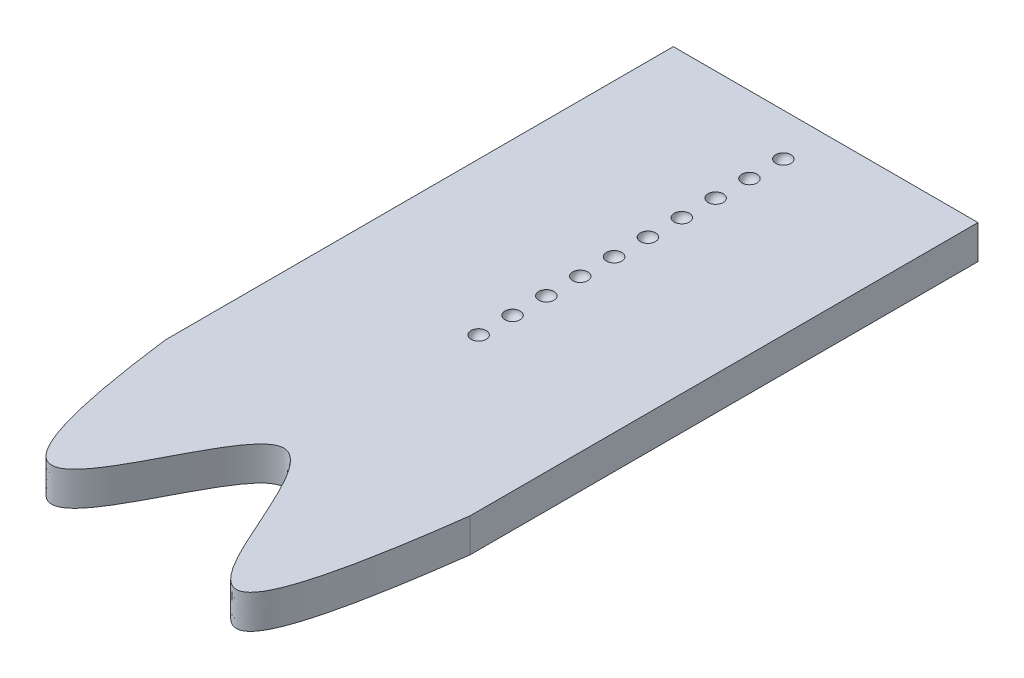
ISO-10303-21;
HEADER;
FILE_DESCRIPTION(('STEP AP214'),'2;1');
FILE_NAME('part.step','',(''),(''),'','','');
FILE_SCHEMA(('AUTOMOTIVE_DESIGN { 1 0 10303 214 1 1 1 1 }'));
ENDSEC;
DATA;
#1=APPLICATION_CONTEXT('core data for automotive mechanical design processes');
#2=APPLICATION_PROTOCOL_DEFINITION('international standard','automotive_design',2000,#1);
#3=PRODUCT_CONTEXT('',#1,'mechanical');
#4=PRODUCT('Part','Part','',(#3));
#5=PRODUCT_RELATED_PRODUCT_CATEGORY('part','',(#4));
#6=PRODUCT_DEFINITION_FORMATION('','',#4);
#7=PRODUCT_DEFINITION_CONTEXT('part definition',#1,'design');
#8=PRODUCT_DEFINITION('design','',#6,#7);
#9=PRODUCT_DEFINITION_SHAPE('','',#8);
#10=(LENGTH_UNIT() NAMED_UNIT(*) SI_UNIT(.MILLI.,.METRE.));
#11=(NAMED_UNIT(*) PLANE_ANGLE_UNIT() SI_UNIT($,.RADIAN.));
#12=(NAMED_UNIT(*) SI_UNIT($,.STERADIAN.) SOLID_ANGLE_UNIT());
#13=UNCERTAINTY_MEASURE_WITH_UNIT(LENGTH_MEASURE(1.E-05),#10,'distance_accuracy_value','');
#14=(GEOMETRIC_REPRESENTATION_CONTEXT(3) GLOBAL_UNCERTAINTY_ASSIGNED_CONTEXT((#13)) GLOBAL_UNIT_ASSIGNED_CONTEXT((#10,
#11,#12)) REPRESENTATION_CONTEXT('',''));
#15=CARTESIAN_POINT('',(0.,0.,0.));
#16=DIRECTION('',(0.,0.,1.));
#17=DIRECTION('',(1.,0.,0.));
#18=AXIS2_PLACEMENT_3D('',#15,#16,#17);
#19=CARTESIAN_POINT('',(-42.2653924914676,5.08,-3.81296928327645));
#20=DIRECTION('',(1.,0.,0.));
#21=DIRECTION('',(0.,0.,-1.));
#22=AXIS2_PLACEMENT_3D('',#19,#20,#21);
#23=PLANE('',#22);
#24=DIRECTION('',(0.,0.,1.));
#25=VECTOR('',#24,1.);
#26=CARTESIAN_POINT('',(-42.2653924914676,0.,-3.81296928327645));
#27=LINE('',#26,#25);
#28=CARTESIAN_POINT('',(-42.2653924914676,0.,-3.81296928327645));
#29=VERTEX_POINT('',#28);
#30=CARTESIAN_POINT('',(-42.2653924914676,0.,72.3870307167236));
#31=VERTEX_POINT('',#30);
#32=EDGE_CURVE('E113',#29,#31,#27,.T.);
#33=ORIENTED_EDGE('',*,*,#32,.T.);
#34=DIRECTION('',(0.,-1.,0.));
#35=VECTOR('',#34,1.);
#36=CARTESIAN_POINT('',(-42.2653924914676,5.08,72.3870307167236));
#37=LINE('',#36,#35);
#38=CARTESIAN_POINT('',(-42.2653924914676,5.08,72.3870307167236));
#39=VERTEX_POINT('',#38);
#40=EDGE_CURVE('E11',#39,#31,#37,.T.);
#41=ORIENTED_EDGE('',*,*,#40,.F.);
#42=DIRECTION('',(0.,0.,1.));
#43=VECTOR('',#42,1.);
#44=CARTESIAN_POINT('',(-42.2653924914676,5.08,-3.81296928327645));
#45=LINE('',#44,#43);
#46=CARTESIAN_POINT('',(-42.2653924914676,5.08,-3.81296928327645));
#47=VERTEX_POINT('',#46);
#48=EDGE_CURVE('E93',#47,#39,#45,.T.);
#49=ORIENTED_EDGE('',*,*,#48,.F.);
#50=DIRECTION('',(0.,-1.,0.));
#51=VECTOR('',#50,1.);
#52=CARTESIAN_POINT('',(-42.2653924914676,5.08,-3.81296928327645));
#53=LINE('',#52,#51);
#54=EDGE_CURVE('E106',#47,#29,#53,.T.);
#55=ORIENTED_EDGE('',*,*,#54,.T.);
#56=EDGE_LOOP('',(#33,#41,#49,#55));
#57=FACE_BOUND('',#56,.T.);
#58=ADVANCED_FACE('F39',(#57),#23,.F.);
#59=CARTESIAN_POINT('',(-42.2653924914676,5.08,72.3870307167236));
#60=CARTESIAN_POINT('',(-35.6116287089528,5.08,124.895548508635));
#61=CARTESIAN_POINT('',(-17.863111268053,5.08,27.5825207457818));
#62=CARTESIAN_POINT('',(-4.18793221957666,5.08,130.397350190675));
#63=CARTESIAN_POINT('',(3.45460750853244,5.08,72.3870307167236));
#64=B_SPLINE_CURVE_WITH_KNOTS('',3,(#59,#60,#61,#62,#63),.UNSPECIFIED.,.F.,.F.,(4,1,4),(0.,
0.483362267142511,1.),.UNSPECIFIED.);
#65=DIRECTION('',(0.,-1.,0.));
#66=VECTOR('',#65,1.);
#67=SURFACE_OF_LINEAR_EXTRUSION('',#64,#66);
#68=CARTESIAN_POINT('',(-42.2653924914676,0.,72.3870307167236));
#69=CARTESIAN_POINT('',(-35.6116287089528,0.,124.895548508635));
#70=CARTESIAN_POINT('',(-17.863111268053,0.,27.5825207457818));
#71=CARTESIAN_POINT('',(-4.18793221957666,0.,130.397350190675));
#72=CARTESIAN_POINT('',(3.45460750853244,0.,72.3870307167236));
#73=B_SPLINE_CURVE_WITH_KNOTS('',3,(#68,#69,#70,#71,#72),.UNSPECIFIED.,.F.,.F.,(4,1,4),(0.,
0.483362267142511,1.),.UNSPECIFIED.);
#74=CARTESIAN_POINT('',(3.45460750853243,0.,72.3870307167236));
#75=VERTEX_POINT('',#74);
#76=EDGE_CURVE('E98',#31,#75,#73,.T.);
#77=ORIENTED_EDGE('',*,*,#76,.T.);
#78=DIRECTION('',(0.,-1.,0.));
#79=VECTOR('',#78,1.);
#80=CARTESIAN_POINT('',(3.45460750853243,5.08,72.3870307167236));
#81=LINE('',#80,#79);
#82=CARTESIAN_POINT('',(3.45460750853243,5.08,72.3870307167236));
#83=VERTEX_POINT('',#82);
#84=EDGE_CURVE('E49',#83,#75,#81,.T.);
#85=ORIENTED_EDGE('',*,*,#84,.F.);
#86=EDGE_CURVE('E88',#39,#83,#64,.T.);
#87=ORIENTED_EDGE('',*,*,#86,.F.);
#88=ORIENTED_EDGE('',*,*,#40,.T.);
#89=EDGE_LOOP('',(#77,#85,#87,#88));
#90=FACE_BOUND('',#89,.T.);
#91=ADVANCED_FACE('F97',(#90),#67,.F.);
#92=CARTESIAN_POINT('',(3.45460750853242,5.08,-3.81296928327645));
#93=DIRECTION('',(-1.,0.,0.));
#94=DIRECTION('',(0.,0.,1.));
#95=AXIS2_PLACEMENT_3D('',#92,#93,#94);
#96=PLANE('',#95);
#97=DIRECTION('',(0.,0.,-1.));
#98=VECTOR('',#97,1.);
#99=CARTESIAN_POINT('',(3.45460750853242,0.,-3.81296928327645));
#100=LINE('',#99,#98);
#101=CARTESIAN_POINT('',(3.45460750853242,0.,-3.81296928327645));
#102=VERTEX_POINT('',#101);
#103=EDGE_CURVE('E75',#75,#102,#100,.T.);
#104=ORIENTED_EDGE('',*,*,#103,.T.);
#105=DIRECTION('',(0.,-1.,0.));
#106=VECTOR('',#105,1.);
#107=CARTESIAN_POINT('',(3.45460750853242,5.08,-3.81296928327645));
#108=LINE('',#107,#106);
#109=CARTESIAN_POINT('',(3.45460750853242,5.08,-3.81296928327645));
#110=VERTEX_POINT('',#109);
#111=EDGE_CURVE('E100',#110,#102,#108,.T.);
#112=ORIENTED_EDGE('',*,*,#111,.F.);
#113=DIRECTION('',(0.,0.,-1.));
#114=VECTOR('',#113,1.);
#115=CARTESIAN_POINT('',(3.45460750853242,5.08,-3.81296928327645));
#116=LINE('',#115,#114);
#117=EDGE_CURVE('E91',#83,#110,#116,.T.);
#118=ORIENTED_EDGE('',*,*,#117,.F.);
#119=ORIENTED_EDGE('',*,*,#84,.T.);
#120=EDGE_LOOP('',(#104,#112,#118,#119));
#121=FACE_BOUND('',#120,.T.);
#122=ADVANCED_FACE('F102',(#121),#96,.F.);
#123=CARTESIAN_POINT('',(-42.2653924914676,5.08,-3.81296928327645));
#124=DIRECTION('',(0.,0.,1.));
#125=DIRECTION('',(1.,0.,0.));
#126=AXIS2_PLACEMENT_3D('',#123,#124,#125);
#127=PLANE('',#126);
#128=DIRECTION('',(-1.,0.,0.));
#129=VECTOR('',#128,1.);
#130=CARTESIAN_POINT('',(-42.2653924914676,0.,-3.81296928327645));
#131=LINE('',#130,#129);
#132=EDGE_CURVE('E81',#102,#29,#131,.T.);
#133=ORIENTED_EDGE('',*,*,#132,.T.);
#134=ORIENTED_EDGE('',*,*,#54,.F.);
#135=DIRECTION('',(-1.,0.,0.));
#136=VECTOR('',#135,1.);
#137=CARTESIAN_POINT('',(-42.2653924914676,5.08,-3.81296928327645));
#138=LINE('',#137,#136);
#139=EDGE_CURVE('E58',#110,#47,#138,.T.);
#140=ORIENTED_EDGE('',*,*,#139,.F.);
#141=ORIENTED_EDGE('',*,*,#111,.T.);
#142=EDGE_LOOP('',(#133,#134,#140,#141));
#143=FACE_BOUND('',#142,.T.);
#144=ADVANCED_FACE('F177',(#143),#127,.F.);
#145=CARTESIAN_POINT('',(-18.6211082933293,5.08,77.7101564924303));
#146=DIRECTION('',(0.,-1.,0.));
#147=DIRECTION('',(0.,0.,-1.));
#148=AXIS2_PLACEMENT_3D('',#145,#146,#147);
#149=PLANE('',#148);
#150=CARTESIAN_POINT('',(-19.4053924914676,5.08,48.2570307167236));
#151=DIRECTION('',(0.,-1.,0.));
#152=DIRECTION('',(0.,0.,-1.));
#153=AXIS2_PLACEMENT_3D('',#150,#151,#152);
#154=CIRCLE('',#153,1.143);
#155=CARTESIAN_POINT('',(-19.4053924914676,5.08,47.1140307167236));
#156=VERTEX_POINT('',#155);
#157=EDGE_CURVE('E42',#156,#156,#154,.F.);
#158=ORIENTED_EDGE('',*,*,#157,.F.);
#159=EDGE_LOOP('',(#158));
#160=FACE_BOUND('',#159,.T.);
#161=CARTESIAN_POINT('',(-19.4053924914676,5.08,43.1770307167236));
#162=DIRECTION('',(0.,-1.,0.));
#163=DIRECTION('',(0.,0.,-1.));
#164=AXIS2_PLACEMENT_3D('',#161,#162,#163);
#165=CIRCLE('',#164,1.143);
#166=CARTESIAN_POINT('',(-19.4053924914676,5.08,42.0340307167236));
#167=VERTEX_POINT('',#166);
#168=EDGE_CURVE('E163',#167,#167,#165,.F.);
#169=ORIENTED_EDGE('',*,*,#168,.F.);
#170=EDGE_LOOP('',(#169));
#171=FACE_BOUND('',#170,.T.);
#172=CARTESIAN_POINT('',(-19.4053924914676,5.08,38.0970307167236));
#173=DIRECTION('',(0.,-1.,0.));
#174=DIRECTION('',(0.,0.,-1.));
#175=AXIS2_PLACEMENT_3D('',#172,#173,#174);
#176=CIRCLE('',#175,1.143);
#177=CARTESIAN_POINT('',(-19.4053924914676,5.08,36.9540307167236));
#178=VERTEX_POINT('',#177);
#179=EDGE_CURVE('E160',#178,#178,#176,.F.);
#180=ORIENTED_EDGE('',*,*,#179,.F.);
#181=EDGE_LOOP('',(#180));
#182=FACE_BOUND('',#181,.T.);
#183=CARTESIAN_POINT('',(-19.4053924914676,5.08,33.0170307167236));
#184=DIRECTION('',(0.,-1.,0.));
#185=DIRECTION('',(0.,0.,-1.));
#186=AXIS2_PLACEMENT_3D('',#183,#184,#185);
#187=CIRCLE('',#186,1.143);
#188=CARTESIAN_POINT('',(-19.4053924914676,5.08,31.8740307167236));
#189=VERTEX_POINT('',#188);
#190=EDGE_CURVE('E156',#189,#189,#187,.F.);
#191=ORIENTED_EDGE('',*,*,#190,.F.);
#192=EDGE_LOOP('',(#191));
#193=FACE_BOUND('',#192,.T.);
#194=CARTESIAN_POINT('',(-19.4053924914676,5.08,27.9370307167236));
#195=DIRECTION('',(0.,-1.,0.));
#196=DIRECTION('',(0.,0.,-1.));
#197=AXIS2_PLACEMENT_3D('',#194,#195,#196);
#198=CIRCLE('',#197,1.143);
#199=CARTESIAN_POINT('',(-19.4053924914676,5.08,26.7940307167236));
#200=VERTEX_POINT('',#199);
#201=EDGE_CURVE('E152',#200,#200,#198,.F.);
#202=ORIENTED_EDGE('',*,*,#201,.F.);
#203=EDGE_LOOP('',(#202));
#204=FACE_BOUND('',#203,.T.);
#205=CARTESIAN_POINT('',(-19.4053924914676,5.08,22.8570307167236));
#206=DIRECTION('',(0.,-1.,0.));
#207=DIRECTION('',(0.,0.,-1.));
#208=AXIS2_PLACEMENT_3D('',#205,#206,#207);
#209=CIRCLE('',#208,1.143);
#210=CARTESIAN_POINT('',(-19.4053924914676,5.08,21.7140307167236));
#211=VERTEX_POINT('',#210);
#212=EDGE_CURVE('E148',#211,#211,#209,.F.);
#213=ORIENTED_EDGE('',*,*,#212,.F.);
#214=EDGE_LOOP('',(#213));
#215=FACE_BOUND('',#214,.T.);
#216=CARTESIAN_POINT('',(-19.4053924914676,5.08,17.7770307167236));
#217=DIRECTION('',(0.,-1.,0.));
#218=DIRECTION('',(0.,0.,-1.));
#219=AXIS2_PLACEMENT_3D('',#216,#217,#218);
#220=CIRCLE('',#219,1.143);
#221=CARTESIAN_POINT('',(-19.4053924914676,5.08,16.6340307167236));
#222=VERTEX_POINT('',#221);
#223=EDGE_CURVE('E144',#222,#222,#220,.F.);
#224=ORIENTED_EDGE('',*,*,#223,.F.);
#225=EDGE_LOOP('',(#224));
#226=FACE_BOUND('',#225,.T.);
#227=CARTESIAN_POINT('',(-19.4053924914676,5.08,12.6970307167236));
#228=DIRECTION('',(0.,-1.,0.));
#229=DIRECTION('',(0.,0.,-1.));
#230=AXIS2_PLACEMENT_3D('',#227,#228,#229);
#231=CIRCLE('',#230,1.143);
#232=CARTESIAN_POINT('',(-19.4053924914676,5.08,11.5540307167236));
#233=VERTEX_POINT('',#232);
#234=EDGE_CURVE('E140',#233,#233,#231,.F.);
#235=ORIENTED_EDGE('',*,*,#234,.F.);
#236=EDGE_LOOP('',(#235));
#237=FACE_BOUND('',#236,.T.);
#238=CARTESIAN_POINT('',(-19.4053924914676,5.08,7.61703071672355));
#239=DIRECTION('',(0.,-1.,0.));
#240=DIRECTION('',(0.,0.,-1.));
#241=AXIS2_PLACEMENT_3D('',#238,#239,#240);
#242=CIRCLE('',#241,1.143);
#243=CARTESIAN_POINT('',(-19.4053924914676,5.08,6.47403071672356));
#244=VERTEX_POINT('',#243);
#245=EDGE_CURVE('E136',#244,#244,#242,.F.);
#246=ORIENTED_EDGE('',*,*,#245,.F.);
#247=EDGE_LOOP('',(#246));
#248=FACE_BOUND('',#247,.T.);
#249=CARTESIAN_POINT('',(-19.4053924914676,5.08,2.53703071672355));
#250=DIRECTION('',(0.,-1.,0.));
#251=DIRECTION('',(0.,0.,-1.));
#252=AXIS2_PLACEMENT_3D('',#249,#250,#251);
#253=CIRCLE('',#252,1.143);
#254=CARTESIAN_POINT('',(-19.4053924914676,5.08,1.39403071672356));
#255=VERTEX_POINT('',#254);
#256=EDGE_CURVE('E117',#255,#255,#253,.F.);
#257=ORIENTED_EDGE('',*,*,#256,.F.);
#258=EDGE_LOOP('',(#257));
#259=FACE_BOUND('',#258,.T.);
#260=ORIENTED_EDGE('',*,*,#48,.T.);
#261=ORIENTED_EDGE('',*,*,#86,.T.);
#262=ORIENTED_EDGE('',*,*,#117,.T.);
#263=ORIENTED_EDGE('',*,*,#139,.T.);
#264=EDGE_LOOP('',(#260,#261,#262,#263));
#265=FACE_BOUND('',#264,.T.);
#266=ADVANCED_FACE('F89',(#160,#171,#182,#193,#204,#215,#226,#237,#248,#259,#265),#149,.F.);
#267=CARTESIAN_POINT('',(-18.6211082933293,0.,77.7101564924303));
#268=DIRECTION('',(0.,-1.,0.));
#269=DIRECTION('',(0.,0.,-1.));
#270=AXIS2_PLACEMENT_3D('',#267,#268,#269);
#271=PLANE('',#270);
#272=ORIENTED_EDGE('',*,*,#32,.F.);
#273=ORIENTED_EDGE('',*,*,#132,.F.);
#274=ORIENTED_EDGE('',*,*,#103,.F.);
#275=ORIENTED_EDGE('',*,*,#76,.F.);
#276=EDGE_LOOP('',(#272,#273,#274,#275));
#277=FACE_BOUND('',#276,.T.);
#278=ADVANCED_FACE('F176',(#277),#271,.T.);
#279=CARTESIAN_POINT('',(-19.4053924914676,5.08,2.53703071672355));
#280=DIRECTION('',(-1.,0.,0.));
#281=DIRECTION('',(0.,0.,-1.));
#282=AXIS2_PLACEMENT_3D('',#279,#280,#281);
#283=SPHERICAL_SURFACE('',#282,1.143);
#284=CARTESIAN_POINT('',(-19.4053924914676,5.08,2.53703071672355));
#285=DIRECTION('',(0.,-1.,0.));
#286=DIRECTION('',(0.,0.,-1.));
#287=AXIS2_PLACEMENT_3D('',#284,#285,#286);
#288=SPHERICAL_SURFACE('',#287,1.143);
#289=ORIENTED_EDGE('',*,*,#256,.T.);
#290=EDGE_LOOP('',(#289));
#291=FACE_BOUND('',#290,.T.);
#292=ADVANCED_FACE('F196',(#291),#288,.F.);
#293=CARTESIAN_POINT('',(-19.4053924914676,5.08,7.61703071672355));
#294=DIRECTION('',(-1.,0.,0.));
#295=DIRECTION('',(0.,0.,-1.));
#296=AXIS2_PLACEMENT_3D('',#293,#294,#295);
#297=SPHERICAL_SURFACE('',#296,1.143);
#298=CARTESIAN_POINT('',(-19.4053924914676,5.08,7.61703071672355));
#299=DIRECTION('',(0.,-1.,0.));
#300=DIRECTION('',(0.,0.,-1.));
#301=AXIS2_PLACEMENT_3D('',#298,#299,#300);
#302=SPHERICAL_SURFACE('',#301,1.143);
#303=ORIENTED_EDGE('',*,*,#245,.T.);
#304=EDGE_LOOP('',(#303));
#305=FACE_BOUND('',#304,.T.);
#306=ADVANCED_FACE('F198',(#305),#302,.F.);
#307=CARTESIAN_POINT('',(-19.4053924914676,5.08,12.6970307167236));
#308=DIRECTION('',(-1.,0.,0.));
#309=DIRECTION('',(0.,0.,-1.));
#310=AXIS2_PLACEMENT_3D('',#307,#308,#309);
#311=SPHERICAL_SURFACE('',#310,1.143);
#312=CARTESIAN_POINT('',(-19.4053924914676,5.08,12.6970307167236));
#313=DIRECTION('',(0.,-1.,0.));
#314=DIRECTION('',(0.,0.,-1.));
#315=AXIS2_PLACEMENT_3D('',#312,#313,#314);
#316=SPHERICAL_SURFACE('',#315,1.143);
#317=ORIENTED_EDGE('',*,*,#234,.T.);
#318=EDGE_LOOP('',(#317));
#319=FACE_BOUND('',#318,.T.);
#320=ADVANCED_FACE('F204',(#319),#316,.F.);
#321=CARTESIAN_POINT('',(-19.4053924914676,5.08,17.7770307167236));
#322=DIRECTION('',(-1.,0.,0.));
#323=DIRECTION('',(0.,0.,-1.));
#324=AXIS2_PLACEMENT_3D('',#321,#322,#323);
#325=SPHERICAL_SURFACE('',#324,1.143);
#326=CARTESIAN_POINT('',(-19.4053924914676,5.08,17.7770307167236));
#327=DIRECTION('',(0.,-1.,0.));
#328=DIRECTION('',(0.,0.,-1.));
#329=AXIS2_PLACEMENT_3D('',#326,#327,#328);
#330=SPHERICAL_SURFACE('',#329,1.143);
#331=ORIENTED_EDGE('',*,*,#223,.T.);
#332=EDGE_LOOP('',(#331));
#333=FACE_BOUND('',#332,.T.);
#334=ADVANCED_FACE('F266',(#333),#330,.F.);
#335=CARTESIAN_POINT('',(-19.4053924914676,5.08,22.8570307167236));
#336=DIRECTION('',(-1.,0.,0.));
#337=DIRECTION('',(0.,0.,-1.));
#338=AXIS2_PLACEMENT_3D('',#335,#336,#337);
#339=SPHERICAL_SURFACE('',#338,1.143);
#340=CARTESIAN_POINT('',(-19.4053924914676,5.08,22.8570307167236));
#341=DIRECTION('',(0.,-1.,0.));
#342=DIRECTION('',(0.,0.,-1.));
#343=AXIS2_PLACEMENT_3D('',#340,#341,#342);
#344=SPHERICAL_SURFACE('',#343,1.143);
#345=ORIENTED_EDGE('',*,*,#212,.T.);
#346=EDGE_LOOP('',(#345));
#347=FACE_BOUND('',#346,.T.);
#348=ADVANCED_FACE('F275',(#347),#344,.F.);
#349=CARTESIAN_POINT('',(-19.4053924914676,5.08,27.9370307167236));
#350=DIRECTION('',(-1.,0.,0.));
#351=DIRECTION('',(0.,0.,-1.));
#352=AXIS2_PLACEMENT_3D('',#349,#350,#351);
#353=SPHERICAL_SURFACE('',#352,1.143);
#354=CARTESIAN_POINT('',(-19.4053924914676,5.08,27.9370307167236));
#355=DIRECTION('',(0.,-1.,0.));
#356=DIRECTION('',(0.,0.,-1.));
#357=AXIS2_PLACEMENT_3D('',#354,#355,#356);
#358=SPHERICAL_SURFACE('',#357,1.143);
#359=ORIENTED_EDGE('',*,*,#201,.T.);
#360=EDGE_LOOP('',(#359));
#361=FACE_BOUND('',#360,.T.);
#362=ADVANCED_FACE('F284',(#361),#358,.F.);
#363=CARTESIAN_POINT('',(-19.4053924914676,5.08,33.0170307167236));
#364=DIRECTION('',(-1.,0.,0.));
#365=DIRECTION('',(0.,0.,-1.));
#366=AXIS2_PLACEMENT_3D('',#363,#364,#365);
#367=SPHERICAL_SURFACE('',#366,1.143);
#368=CARTESIAN_POINT('',(-19.4053924914676,5.08,33.0170307167236));
#369=DIRECTION('',(0.,-1.,0.));
#370=DIRECTION('',(0.,0.,-1.));
#371=AXIS2_PLACEMENT_3D('',#368,#369,#370);
#372=SPHERICAL_SURFACE('',#371,1.143);
#373=ORIENTED_EDGE('',*,*,#190,.T.);
#374=EDGE_LOOP('',(#373));
#375=FACE_BOUND('',#374,.T.);
#376=ADVANCED_FACE('F293',(#375),#372,.F.);
#377=CARTESIAN_POINT('',(-19.4053924914676,5.08,38.0970307167236));
#378=DIRECTION('',(-1.,0.,0.));
#379=DIRECTION('',(0.,0.,-1.));
#380=AXIS2_PLACEMENT_3D('',#377,#378,#379);
#381=SPHERICAL_SURFACE('',#380,1.143);
#382=CARTESIAN_POINT('',(-19.4053924914676,5.08,38.0970307167236));
#383=DIRECTION('',(0.,-1.,0.));
#384=DIRECTION('',(0.,0.,-1.));
#385=AXIS2_PLACEMENT_3D('',#382,#383,#384);
#386=SPHERICAL_SURFACE('',#385,1.143);
#387=ORIENTED_EDGE('',*,*,#179,.T.);
#388=EDGE_LOOP('',(#387));
#389=FACE_BOUND('',#388,.T.);
#390=ADVANCED_FACE('F302',(#389),#386,.F.);
#391=CARTESIAN_POINT('',(-19.4053924914676,5.08,43.1770307167236));
#392=DIRECTION('',(-1.,0.,0.));
#393=DIRECTION('',(0.,0.,-1.));
#394=AXIS2_PLACEMENT_3D('',#391,#392,#393);
#395=SPHERICAL_SURFACE('',#394,1.143);
#396=CARTESIAN_POINT('',(-19.4053924914676,5.08,43.1770307167236));
#397=DIRECTION('',(0.,-1.,0.));
#398=DIRECTION('',(0.,0.,-1.));
#399=AXIS2_PLACEMENT_3D('',#396,#397,#398);
#400=SPHERICAL_SURFACE('',#399,1.143);
#401=ORIENTED_EDGE('',*,*,#168,.T.);
#402=EDGE_LOOP('',(#401));
#403=FACE_BOUND('',#402,.T.);
#404=ADVANCED_FACE('F311',(#403),#400,.F.);
#405=CARTESIAN_POINT('',(-19.4053924914676,5.08,48.2570307167236));
#406=DIRECTION('',(-1.,0.,0.));
#407=DIRECTION('',(0.,0.,-1.));
#408=AXIS2_PLACEMENT_3D('',#405,#406,#407);
#409=SPHERICAL_SURFACE('',#408,1.143);
#410=CARTESIAN_POINT('',(-19.4053924914676,5.08,48.2570307167236));
#411=DIRECTION('',(0.,-1.,0.));
#412=DIRECTION('',(0.,0.,-1.));
#413=AXIS2_PLACEMENT_3D('',#410,#411,#412);
#414=SPHERICAL_SURFACE('',#413,1.143);
#415=ORIENTED_EDGE('',*,*,#157,.T.);
#416=EDGE_LOOP('',(#415));
#417=FACE_BOUND('',#416,.T.);
#418=ADVANCED_FACE('F172',(#417),#414,.F.);
#419=CLOSED_SHELL('',(#58,#91,#122,#144,#266,#278,#292,#306,#320,#334,#348,#362,#376,#390,#404,#418));
#420=MANIFOLD_SOLID_BREP('B2',#419);
#421=ADVANCED_BREP_SHAPE_REPRESENTATION('',(#18,#420),#14);
#422=SHAPE_DEFINITION_REPRESENTATION(#9,#421);
ENDSEC;
END-ISO-10303-21;
